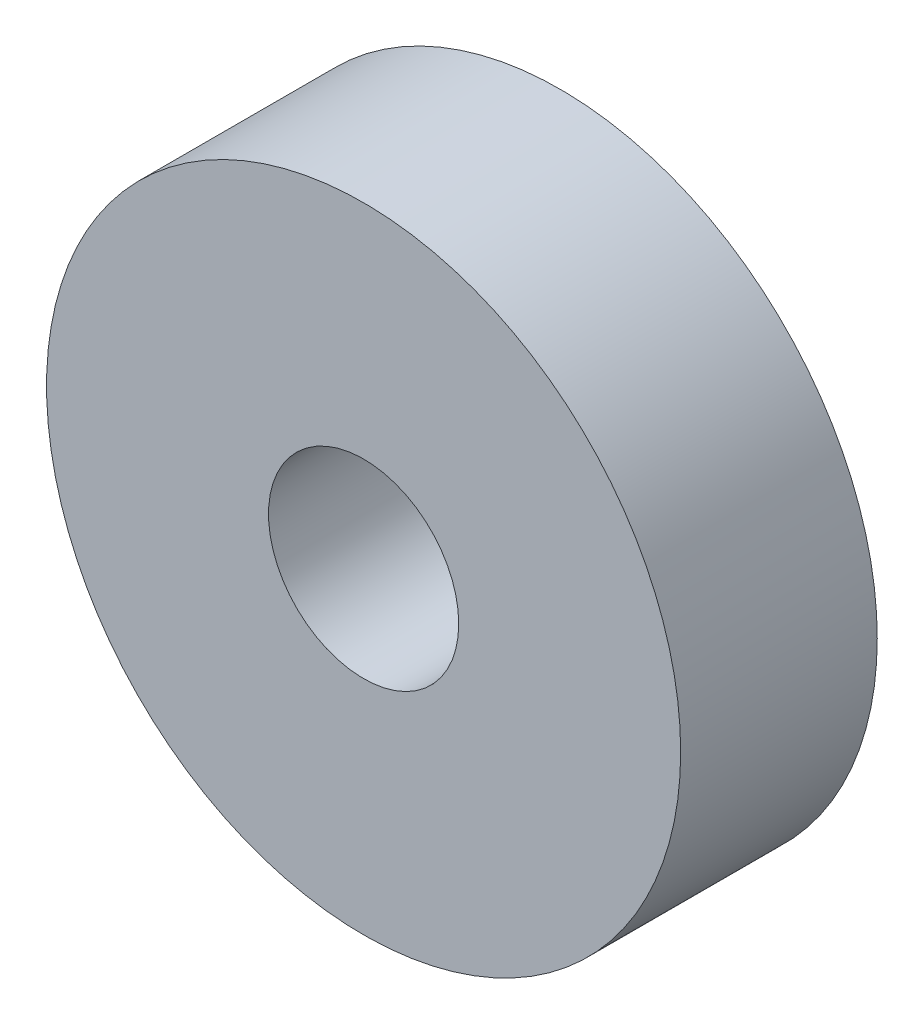
ISO-10303-21;
HEADER;
FILE_DESCRIPTION(('STEP AP214'),'2;1');
FILE_NAME('part.step','',(''),(''),'','','');
FILE_SCHEMA(('AUTOMOTIVE_DESIGN { 1 0 10303 214 1 1 1 1 }'));
ENDSEC;
DATA;
#1=APPLICATION_CONTEXT('core data for automotive mechanical design processes');
#2=APPLICATION_PROTOCOL_DEFINITION('international standard','automotive_design',2000,#1);
#3=PRODUCT_CONTEXT('',#1,'mechanical');
#4=PRODUCT('Part','Part','',(#3));
#5=PRODUCT_RELATED_PRODUCT_CATEGORY('part','',(#4));
#6=PRODUCT_DEFINITION_FORMATION('','',#4);
#7=PRODUCT_DEFINITION_CONTEXT('part definition',#1,'design');
#8=PRODUCT_DEFINITION('design','',#6,#7);
#9=PRODUCT_DEFINITION_SHAPE('','',#8);
#10=(LENGTH_UNIT() NAMED_UNIT(*) SI_UNIT(.MILLI.,.METRE.));
#11=(NAMED_UNIT(*) PLANE_ANGLE_UNIT() SI_UNIT($,.RADIAN.));
#12=(NAMED_UNIT(*) SI_UNIT($,.STERADIAN.) SOLID_ANGLE_UNIT());
#13=UNCERTAINTY_MEASURE_WITH_UNIT(LENGTH_MEASURE(1.E-05),#10,'distance_accuracy_value','');
#14=(GEOMETRIC_REPRESENTATION_CONTEXT(3) GLOBAL_UNCERTAINTY_ASSIGNED_CONTEXT((#13)) GLOBAL_UNIT_ASSIGNED_CONTEXT((#10,
#11,#12)) REPRESENTATION_CONTEXT('',''));
#15=CARTESIAN_POINT('',(0.,0.,0.));
#16=DIRECTION('',(0.,0.,1.));
#17=DIRECTION('',(1.,0.,0.));
#18=AXIS2_PLACEMENT_3D('',#15,#16,#17);
#19=CARTESIAN_POINT('',(0.,0.,31.));
#20=DIRECTION('',(0.,0.,-1.));
#21=DIRECTION('',(-1.,0.,0.));
#22=AXIS2_PLACEMENT_3D('',#19,#20,#21);
#23=CYLINDRICAL_SURFACE('',#22,50.);
#24=CARTESIAN_POINT('',(0.,0.,31.));
#25=DIRECTION('',(0.,0.,1.));
#26=DIRECTION('',(1.,0.,0.));
#27=AXIS2_PLACEMENT_3D('',#24,#25,#26);
#28=CIRCLE('',#27,50.);
#29=CARTESIAN_POINT('',(50.,0.,31.));
#30=VERTEX_POINT('',#29);
#31=EDGE_CURVE('E10',#30,#30,#28,.T.);
#32=ORIENTED_EDGE('',*,*,#31,.F.);
#33=EDGE_LOOP('',(#32));
#34=FACE_BOUND('',#33,.T.);
#35=CARTESIAN_POINT('',(0.,0.,0.));
#36=DIRECTION('',(0.,0.,1.));
#37=DIRECTION('',(1.,0.,0.));
#38=AXIS2_PLACEMENT_3D('',#35,#36,#37);
#39=CIRCLE('',#38,50.);
#40=CARTESIAN_POINT('',(50.,0.,0.));
#41=VERTEX_POINT('',#40);
#42=EDGE_CURVE('E44',#41,#41,#39,.T.);
#43=ORIENTED_EDGE('',*,*,#42,.T.);
#44=EDGE_LOOP('',(#43));
#45=FACE_BOUND('',#44,.T.);
#46=ADVANCED_FACE('F41',(#34,#45),#23,.T.);
#47=CARTESIAN_POINT('',(0.,0.,31.));
#48=DIRECTION('',(0.,0.,1.));
#49=DIRECTION('',(1.,0.,0.));
#50=AXIS2_PLACEMENT_3D('',#47,#48,#49);
#51=PLANE('',#50);
#52=CARTESIAN_POINT('',(0.,0.,31.));
#53=DIRECTION('',(0.,0.,1.));
#54=DIRECTION('',(1.,0.,0.));
#55=AXIS2_PLACEMENT_3D('',#52,#53,#54);
#56=CIRCLE('',#55,15.);
#57=CARTESIAN_POINT('',(15.,0.,31.));
#58=VERTEX_POINT('',#57);
#59=EDGE_CURVE('E55',#58,#58,#56,.T.);
#60=ORIENTED_EDGE('',*,*,#59,.F.);
#61=EDGE_LOOP('',(#60));
#62=FACE_BOUND('',#61,.T.);
#63=ORIENTED_EDGE('',*,*,#31,.T.);
#64=EDGE_LOOP('',(#63));
#65=FACE_BOUND('',#64,.T.);
#66=ADVANCED_FACE('F72',(#62,#65),#51,.T.);
#67=CARTESIAN_POINT('',(0.,0.,0.));
#68=DIRECTION('',(0.,0.,1.));
#69=DIRECTION('',(1.,0.,0.));
#70=AXIS2_PLACEMENT_3D('',#67,#68,#69);
#71=PLANE('',#70);
#72=CARTESIAN_POINT('',(0.,0.,0.));
#73=DIRECTION('',(0.,0.,1.));
#74=DIRECTION('',(1.,0.,0.));
#75=AXIS2_PLACEMENT_3D('',#72,#73,#74);
#76=CIRCLE('',#75,15.);
#77=CARTESIAN_POINT('',(15.,0.,0.));
#78=VERTEX_POINT('',#77);
#79=EDGE_CURVE('E53',#78,#78,#76,.T.);
#80=ORIENTED_EDGE('',*,*,#79,.T.);
#81=EDGE_LOOP('',(#80));
#82=FACE_BOUND('',#81,.T.);
#83=ORIENTED_EDGE('',*,*,#42,.F.);
#84=EDGE_LOOP('',(#83));
#85=FACE_BOUND('',#84,.T.);
#86=ADVANCED_FACE('F63',(#82,#85),#71,.F.);
#87=CARTESIAN_POINT('',(0.,0.,0.));
#88=DIRECTION('',(0.,0.,1.));
#89=DIRECTION('',(1.,0.,0.));
#90=AXIS2_PLACEMENT_3D('',#87,#88,#89);
#91=CYLINDRICAL_SURFACE('',#90,15.);
#92=ORIENTED_EDGE('',*,*,#79,.F.);
#93=EDGE_LOOP('',(#92));
#94=FACE_BOUND('',#93,.T.);
#95=ORIENTED_EDGE('',*,*,#59,.T.);
#96=EDGE_LOOP('',(#95));
#97=FACE_BOUND('',#96,.T.);
#98=ADVANCED_FACE('F66',(#94,#97),#91,.F.);
#99=CLOSED_SHELL('',(#46,#66,#86,#98));
#100=MANIFOLD_SOLID_BREP('B2',#99);
#101=ADVANCED_BREP_SHAPE_REPRESENTATION('',(#18,#100),#14);
#102=SHAPE_DEFINITION_REPRESENTATION(#9,#101);
ENDSEC;
END-ISO-10303-21;
